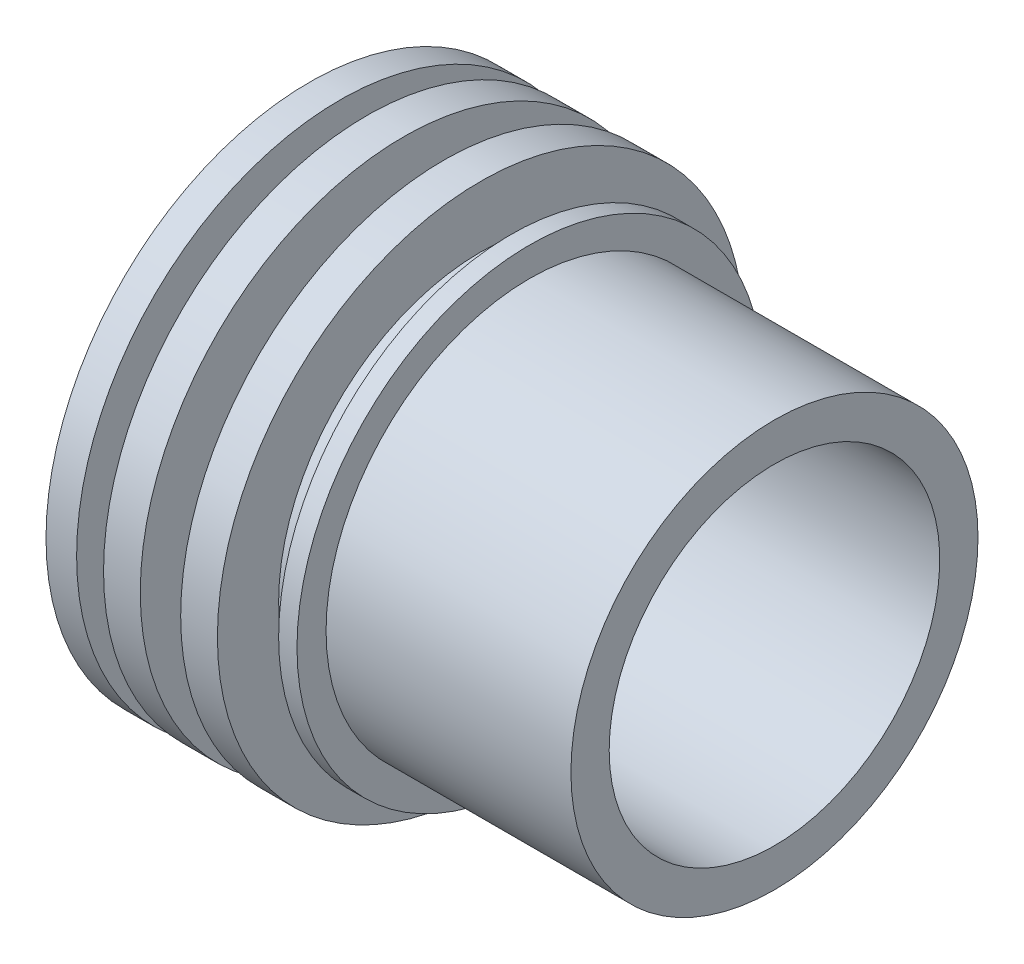
ISO-10303-21;
HEADER;
FILE_DESCRIPTION(('STEP AP214'),'2;1');
FILE_NAME('part.step','',(''),(''),'','','');
FILE_SCHEMA(('AUTOMOTIVE_DESIGN { 1 0 10303 214 1 1 1 1 }'));
ENDSEC;
DATA;
#1=APPLICATION_CONTEXT('core data for automotive mechanical design processes');
#2=APPLICATION_PROTOCOL_DEFINITION('international standard','automotive_design',2000,#1);
#3=PRODUCT_CONTEXT('',#1,'mechanical');
#4=PRODUCT('Part','Part','',(#3));
#5=PRODUCT_RELATED_PRODUCT_CATEGORY('part','',(#4));
#6=PRODUCT_DEFINITION_FORMATION('','',#4);
#7=PRODUCT_DEFINITION_CONTEXT('part definition',#1,'design');
#8=PRODUCT_DEFINITION('design','',#6,#7);
#9=PRODUCT_DEFINITION_SHAPE('','',#8);
#10=(LENGTH_UNIT() NAMED_UNIT(*) SI_UNIT(.MILLI.,.METRE.));
#11=(NAMED_UNIT(*) PLANE_ANGLE_UNIT() SI_UNIT($,.RADIAN.));
#12=(NAMED_UNIT(*) SI_UNIT($,.STERADIAN.) SOLID_ANGLE_UNIT());
#13=UNCERTAINTY_MEASURE_WITH_UNIT(LENGTH_MEASURE(1.E-05),#10,'distance_accuracy_value','');
#14=(GEOMETRIC_REPRESENTATION_CONTEXT(3) GLOBAL_UNCERTAINTY_ASSIGNED_CONTEXT((#13)) GLOBAL_UNIT_ASSIGNED_CONTEXT((#10,
#11,#12)) REPRESENTATION_CONTEXT('',''));
#15=CARTESIAN_POINT('',(0.,0.,0.));
#16=DIRECTION('',(0.,0.,1.));
#17=DIRECTION('',(1.,0.,0.));
#18=AXIS2_PLACEMENT_3D('',#15,#16,#17);
#19=CARTESIAN_POINT('',(29.,0.,0.));
#20=DIRECTION('',(-1.,0.,0.));
#21=DIRECTION('',(0.,0.,1.));
#22=AXIS2_PLACEMENT_3D('',#19,#20,#21);
#23=CYLINDRICAL_SURFACE('',#22,12.7);
#24=CARTESIAN_POINT('',(30.,0.,0.));
#25=DIRECTION('',(1.,0.,0.));
#26=DIRECTION('',(0.,0.,1.));
#27=AXIS2_PLACEMENT_3D('',#24,#25,#26);
#28=CIRCLE('',#27,12.7);
#29=CARTESIAN_POINT('',(30.,0.,12.7));
#30=VERTEX_POINT('',#29);
#31=EDGE_CURVE('E10',#30,#30,#28,.T.);
#32=ORIENTED_EDGE('',*,*,#31,.T.);
#33=EDGE_LOOP('',(#32));
#34=FACE_BOUND('',#33,.T.);
#35=CARTESIAN_POINT('',(28.,0.,0.));
#36=DIRECTION('',(1.,0.,0.));
#37=DIRECTION('',(0.,0.,1.));
#38=AXIS2_PLACEMENT_3D('',#35,#36,#37);
#39=CIRCLE('',#38,12.7);
#40=CARTESIAN_POINT('',(28.,0.,12.7));
#41=VERTEX_POINT('',#40);
#42=EDGE_CURVE('E123',#41,#41,#39,.T.);
#43=ORIENTED_EDGE('',*,*,#42,.F.);
#44=EDGE_LOOP('',(#43));
#45=FACE_BOUND('',#44,.T.);
#46=ADVANCED_FACE('F15',(#34,#45),#23,.F.);
#47=CARTESIAN_POINT('',(30.,0.,13.1));
#48=DIRECTION('',(1.,0.,0.));
#49=DIRECTION('',(0.,0.,1.));
#50=AXIS2_PLACEMENT_3D('',#47,#48,#49);
#51=PLANE('',#50);
#52=CARTESIAN_POINT('',(30.,0.,0.));
#53=DIRECTION('',(1.,0.,0.));
#54=DIRECTION('',(0.,0.,1.));
#55=AXIS2_PLACEMENT_3D('',#52,#53,#54);
#56=CIRCLE('',#55,13.5);
#57=CARTESIAN_POINT('',(30.,0.,13.5));
#58=VERTEX_POINT('',#57);
#59=EDGE_CURVE('E24',#58,#58,#56,.T.);
#60=ORIENTED_EDGE('',*,*,#59,.T.);
#61=EDGE_LOOP('',(#60));
#62=FACE_BOUND('',#61,.T.);
#63=ORIENTED_EDGE('',*,*,#31,.F.);
#64=EDGE_LOOP('',(#63));
#65=FACE_BOUND('',#64,.T.);
#66=ADVANCED_FACE('F166',(#62,#65),#51,.T.);
#67=CARTESIAN_POINT('',(48.,0.,0.));
#68=DIRECTION('',(-1.,0.,0.));
#69=DIRECTION('',(0.,0.,1.));
#70=AXIS2_PLACEMENT_3D('',#67,#68,#69);
#71=CYLINDRICAL_SURFACE('',#70,13.5);
#72=CARTESIAN_POINT('',(66.,0.,0.));
#73=DIRECTION('',(1.,0.,0.));
#74=DIRECTION('',(0.,0.,1.));
#75=AXIS2_PLACEMENT_3D('',#72,#73,#74);
#76=CIRCLE('',#75,13.5);
#77=CARTESIAN_POINT('',(66.,0.,13.5));
#78=VERTEX_POINT('',#77);
#79=EDGE_CURVE('E109',#78,#78,#76,.T.);
#80=ORIENTED_EDGE('',*,*,#79,.T.);
#81=EDGE_LOOP('',(#80));
#82=FACE_BOUND('',#81,.T.);
#83=ORIENTED_EDGE('',*,*,#59,.F.);
#84=EDGE_LOOP('',(#83));
#85=FACE_BOUND('',#84,.T.);
#86=ADVANCED_FACE('F171',(#82,#85),#71,.F.);
#87=CARTESIAN_POINT('',(66.,0.,15.0625));
#88=DIRECTION('',(1.,0.,0.));
#89=DIRECTION('',(0.,0.,1.));
#90=AXIS2_PLACEMENT_3D('',#87,#88,#89);
#91=PLANE('',#90);
#92=CARTESIAN_POINT('',(66.,0.,0.));
#93=DIRECTION('',(1.,0.,0.));
#94=DIRECTION('',(0.,0.,1.));
#95=AXIS2_PLACEMENT_3D('',#92,#93,#94);
#96=CIRCLE('',#95,16.625);
#97=CARTESIAN_POINT('',(66.,0.,16.625));
#98=VERTEX_POINT('',#97);
#99=EDGE_CURVE('E107',#98,#98,#96,.T.);
#100=ORIENTED_EDGE('',*,*,#99,.T.);
#101=EDGE_LOOP('',(#100));
#102=FACE_BOUND('',#101,.T.);
#103=ORIENTED_EDGE('',*,*,#79,.F.);
#104=EDGE_LOOP('',(#103));
#105=FACE_BOUND('',#104,.T.);
#106=ADVANCED_FACE('F229',(#102,#105),#91,.T.);
#107=CARTESIAN_POINT('',(56.,0.,0.));
#108=DIRECTION('',(-1.,0.,0.));
#109=DIRECTION('',(0.,0.,1.));
#110=AXIS2_PLACEMENT_3D('',#107,#108,#109);
#111=CYLINDRICAL_SURFACE('',#110,16.625);
#112=CARTESIAN_POINT('',(46.,0.,0.));
#113=DIRECTION('',(1.,0.,0.));
#114=DIRECTION('',(0.,0.,1.));
#115=AXIS2_PLACEMENT_3D('',#112,#113,#114);
#116=CIRCLE('',#115,16.625);
#117=CARTESIAN_POINT('',(46.,0.,16.625));
#118=VERTEX_POINT('',#117);
#119=EDGE_CURVE('E110',#118,#118,#116,.T.);
#120=ORIENTED_EDGE('',*,*,#119,.T.);
#121=EDGE_LOOP('',(#120));
#122=FACE_BOUND('',#121,.T.);
#123=ORIENTED_EDGE('',*,*,#99,.F.);
#124=EDGE_LOOP('',(#123));
#125=FACE_BOUND('',#124,.T.);
#126=ADVANCED_FACE('F201',(#122,#125),#111,.T.);
#127=CARTESIAN_POINT('',(46.,0.,17.8125));
#128=DIRECTION('',(1.,0.,0.));
#129=DIRECTION('',(0.,0.,1.));
#130=AXIS2_PLACEMENT_3D('',#127,#128,#129);
#131=PLANE('',#130);
#132=CARTESIAN_POINT('',(46.,0.,0.));
#133=DIRECTION('',(1.,0.,0.));
#134=DIRECTION('',(0.,0.,1.));
#135=AXIS2_PLACEMENT_3D('',#132,#133,#134);
#136=CIRCLE('',#135,19.);
#137=CARTESIAN_POINT('',(46.,0.,19.));
#138=VERTEX_POINT('',#137);
#139=EDGE_CURVE('E130',#138,#138,#136,.T.);
#140=ORIENTED_EDGE('',*,*,#139,.T.);
#141=EDGE_LOOP('',(#140));
#142=FACE_BOUND('',#141,.T.);
#143=ORIENTED_EDGE('',*,*,#119,.F.);
#144=EDGE_LOOP('',(#143));
#145=FACE_BOUND('',#144,.T.);
#146=ADVANCED_FACE('F194',(#142,#145),#131,.T.);
#147=CARTESIAN_POINT('',(45.25,0.,0.));
#148=DIRECTION('',(-1.,0.,0.));
#149=DIRECTION('',(0.,0.,1.));
#150=AXIS2_PLACEMENT_3D('',#147,#148,#149);
#151=CYLINDRICAL_SURFACE('',#150,19.);
#152=CARTESIAN_POINT('',(44.5,0.,0.));
#153=DIRECTION('',(1.,0.,0.));
#154=DIRECTION('',(0.,0.,1.));
#155=AXIS2_PLACEMENT_3D('',#152,#153,#154);
#156=CIRCLE('',#155,19.);
#157=CARTESIAN_POINT('',(44.5,0.,19.));
#158=VERTEX_POINT('',#157);
#159=EDGE_CURVE('E128',#158,#158,#156,.T.);
#160=ORIENTED_EDGE('',*,*,#159,.T.);
#161=EDGE_LOOP('',(#160));
#162=FACE_BOUND('',#161,.T.);
#163=ORIENTED_EDGE('',*,*,#139,.F.);
#164=EDGE_LOOP('',(#163));
#165=FACE_BOUND('',#164,.T.);
#166=ADVANCED_FACE('F190',(#162,#165),#151,.T.);
#167=CARTESIAN_POINT('',(44.5,0.,17.75));
#168=DIRECTION('',(-1.,0.,0.));
#169=DIRECTION('',(0.,0.,-1.));
#170=AXIS2_PLACEMENT_3D('',#167,#168,#169);
#171=PLANE('',#170);
#172=CARTESIAN_POINT('',(44.5,0.,0.));
#173=DIRECTION('',(1.,0.,0.));
#174=DIRECTION('',(0.,0.,1.));
#175=AXIS2_PLACEMENT_3D('',#172,#173,#174);
#176=CIRCLE('',#175,16.5);
#177=CARTESIAN_POINT('',(44.5,0.,16.5));
#178=VERTEX_POINT('',#177);
#179=EDGE_CURVE('E102',#178,#178,#176,.T.);
#180=ORIENTED_EDGE('',*,*,#179,.T.);
#181=EDGE_LOOP('',(#180));
#182=FACE_BOUND('',#181,.T.);
#183=ORIENTED_EDGE('',*,*,#159,.F.);
#184=EDGE_LOOP('',(#183));
#185=FACE_BOUND('',#184,.T.);
#186=ADVANCED_FACE('F193',(#182,#185),#171,.T.);
#187=CARTESIAN_POINT('',(43.25,0.,0.));
#188=DIRECTION('',(-1.,0.,0.));
#189=DIRECTION('',(0.,0.,1.));
#190=AXIS2_PLACEMENT_3D('',#187,#188,#189);
#191=CYLINDRICAL_SURFACE('',#190,16.5);
#192=CARTESIAN_POINT('',(42.,0.,0.));
#193=DIRECTION('',(1.,0.,0.));
#194=DIRECTION('',(0.,0.,1.));
#195=AXIS2_PLACEMENT_3D('',#192,#193,#194);
#196=CIRCLE('',#195,16.5);
#197=CARTESIAN_POINT('',(42.,0.,16.5));
#198=VERTEX_POINT('',#197);
#199=EDGE_CURVE('E99',#198,#198,#196,.T.);
#200=ORIENTED_EDGE('',*,*,#199,.T.);
#201=EDGE_LOOP('',(#200));
#202=FACE_BOUND('',#201,.T.);
#203=ORIENTED_EDGE('',*,*,#179,.F.);
#204=EDGE_LOOP('',(#203));
#205=FACE_BOUND('',#204,.T.);
#206=ADVANCED_FACE('F198',(#202,#205),#191,.T.);
#207=CARTESIAN_POINT('',(42.,0.,19.));
#208=DIRECTION('',(1.,0.,0.));
#209=DIRECTION('',(0.,0.,1.));
#210=AXIS2_PLACEMENT_3D('',#207,#208,#209);
#211=PLANE('',#210);
#212=CARTESIAN_POINT('',(42.,0.,0.));
#213=DIRECTION('',(1.,0.,0.));
#214=DIRECTION('',(0.,0.,1.));
#215=AXIS2_PLACEMENT_3D('',#212,#213,#214);
#216=CIRCLE('',#215,21.5);
#217=CARTESIAN_POINT('',(42.,0.,21.5));
#218=VERTEX_POINT('',#217);
#219=EDGE_CURVE('E95',#218,#218,#216,.T.);
#220=ORIENTED_EDGE('',*,*,#219,.T.);
#221=EDGE_LOOP('',(#220));
#222=FACE_BOUND('',#221,.T.);
#223=ORIENTED_EDGE('',*,*,#199,.F.);
#224=EDGE_LOOP('',(#223));
#225=FACE_BOUND('',#224,.T.);
#226=ADVANCED_FACE('F96',(#222,#225),#211,.T.);
#227=CARTESIAN_POINT('',(40.5,0.,0.));
#228=DIRECTION('',(-1.,0.,0.));
#229=DIRECTION('',(0.,0.,1.));
#230=AXIS2_PLACEMENT_3D('',#227,#228,#229);
#231=CYLINDRICAL_SURFACE('',#230,21.5);
#232=CARTESIAN_POINT('',(39.,0.,0.));
#233=DIRECTION('',(1.,0.,0.));
#234=DIRECTION('',(0.,0.,1.));
#235=AXIS2_PLACEMENT_3D('',#232,#233,#234);
#236=CIRCLE('',#235,21.5);
#237=CARTESIAN_POINT('',(39.,0.,21.5));
#238=VERTEX_POINT('',#237);
#239=EDGE_CURVE('E100',#238,#238,#236,.T.);
#240=ORIENTED_EDGE('',*,*,#239,.T.);
#241=EDGE_LOOP('',(#240));
#242=FACE_BOUND('',#241,.T.);
#243=ORIENTED_EDGE('',*,*,#219,.F.);
#244=EDGE_LOOP('',(#243));
#245=FACE_BOUND('',#244,.T.);
#246=ADVANCED_FACE('F181',(#242,#245),#231,.T.);
#247=CARTESIAN_POINT('',(39.,0.,19.));
#248=DIRECTION('',(-1.,0.,0.));
#249=DIRECTION('',(0.,0.,-1.));
#250=AXIS2_PLACEMENT_3D('',#247,#248,#249);
#251=PLANE('',#250);
#252=CARTESIAN_POINT('',(39.,0.,0.));
#253=DIRECTION('',(1.,0.,0.));
#254=DIRECTION('',(0.,0.,1.));
#255=AXIS2_PLACEMENT_3D('',#252,#253,#254);
#256=CIRCLE('',#255,16.5);
#257=CARTESIAN_POINT('',(39.,0.,16.5));
#258=VERTEX_POINT('',#257);
#259=EDGE_CURVE('E104',#258,#258,#256,.T.);
#260=ORIENTED_EDGE('',*,*,#259,.T.);
#261=EDGE_LOOP('',(#260));
#262=FACE_BOUND('',#261,.T.);
#263=ORIENTED_EDGE('',*,*,#239,.F.);
#264=EDGE_LOOP('',(#263));
#265=FACE_BOUND('',#264,.T.);
#266=ADVANCED_FACE('F177',(#262,#265),#251,.T.);
#267=CARTESIAN_POINT('',(37.35,0.,0.));
#268=DIRECTION('',(-1.,0.,0.));
#269=DIRECTION('',(0.,0.,1.));
#270=AXIS2_PLACEMENT_3D('',#267,#268,#269);
#271=CYLINDRICAL_SURFACE('',#270,16.5);
#272=CARTESIAN_POINT('',(35.7,0.,0.));
#273=DIRECTION('',(1.,0.,0.));
#274=DIRECTION('',(0.,0.,1.));
#275=AXIS2_PLACEMENT_3D('',#272,#273,#274);
#276=CIRCLE('',#275,16.5);
#277=CARTESIAN_POINT('',(35.7,0.,16.5));
#278=VERTEX_POINT('',#277);
#279=EDGE_CURVE('E124',#278,#278,#276,.T.);
#280=ORIENTED_EDGE('',*,*,#279,.T.);
#281=EDGE_LOOP('',(#280));
#282=FACE_BOUND('',#281,.T.);
#283=ORIENTED_EDGE('',*,*,#259,.F.);
#284=EDGE_LOOP('',(#283));
#285=FACE_BOUND('',#284,.T.);
#286=ADVANCED_FACE('F180',(#282,#285),#271,.T.);
#287=CARTESIAN_POINT('',(35.7,0.,19.));
#288=DIRECTION('',(1.,0.,0.));
#289=DIRECTION('',(0.,0.,1.));
#290=AXIS2_PLACEMENT_3D('',#287,#288,#289);
#291=PLANE('',#290);
#292=CARTESIAN_POINT('',(35.7,0.,0.));
#293=DIRECTION('',(1.,0.,0.));
#294=DIRECTION('',(0.,0.,1.));
#295=AXIS2_PLACEMENT_3D('',#292,#293,#294);
#296=CIRCLE('',#295,21.5);
#297=CARTESIAN_POINT('',(35.7,0.,21.5));
#298=VERTEX_POINT('',#297);
#299=EDGE_CURVE('E126',#298,#298,#296,.T.);
#300=ORIENTED_EDGE('',*,*,#299,.T.);
#301=EDGE_LOOP('',(#300));
#302=FACE_BOUND('',#301,.T.);
#303=ORIENTED_EDGE('',*,*,#279,.F.);
#304=EDGE_LOOP('',(#303));
#305=FACE_BOUND('',#304,.T.);
#306=ADVANCED_FACE('F209',(#302,#305),#291,.T.);
#307=CARTESIAN_POINT('',(34.2,0.,0.));
#308=DIRECTION('',(-1.,0.,0.));
#309=DIRECTION('',(0.,0.,1.));
#310=AXIS2_PLACEMENT_3D('',#307,#308,#309);
#311=CYLINDRICAL_SURFACE('',#310,21.5);
#312=CARTESIAN_POINT('',(32.7,0.,0.));
#313=DIRECTION('',(1.,0.,0.));
#314=DIRECTION('',(0.,0.,1.));
#315=AXIS2_PLACEMENT_3D('',#312,#313,#314);
#316=CIRCLE('',#315,21.5);
#317=CARTESIAN_POINT('',(32.7,0.,21.5));
#318=VERTEX_POINT('',#317);
#319=EDGE_CURVE('E121',#318,#318,#316,.T.);
#320=ORIENTED_EDGE('',*,*,#319,.T.);
#321=EDGE_LOOP('',(#320));
#322=FACE_BOUND('',#321,.T.);
#323=ORIENTED_EDGE('',*,*,#299,.F.);
#324=EDGE_LOOP('',(#323));
#325=FACE_BOUND('',#324,.T.);
#326=ADVANCED_FACE('F206',(#322,#325),#311,.T.);
#327=CARTESIAN_POINT('',(32.7,0.,19.375));
#328=DIRECTION('',(-1.,0.,0.));
#329=DIRECTION('',(0.,0.,-1.));
#330=AXIS2_PLACEMENT_3D('',#327,#328,#329);
#331=PLANE('',#330);
#332=CARTESIAN_POINT('',(32.7,0.,0.));
#333=DIRECTION('',(1.,0.,0.));
#334=DIRECTION('',(0.,0.,1.));
#335=AXIS2_PLACEMENT_3D('',#332,#333,#334);
#336=CIRCLE('',#335,17.25);
#337=CARTESIAN_POINT('',(32.7,0.,17.25));
#338=VERTEX_POINT('',#337);
#339=EDGE_CURVE('E119',#338,#338,#336,.T.);
#340=ORIENTED_EDGE('',*,*,#339,.T.);
#341=EDGE_LOOP('',(#340));
#342=FACE_BOUND('',#341,.T.);
#343=ORIENTED_EDGE('',*,*,#319,.F.);
#344=EDGE_LOOP('',(#343));
#345=FACE_BOUND('',#344,.T.);
#346=ADVANCED_FACE('F161',(#342,#345),#331,.T.);
#347=CARTESIAN_POINT('',(31.6,0.,0.));
#348=DIRECTION('',(-1.,0.,0.));
#349=DIRECTION('',(0.,0.,1.));
#350=AXIS2_PLACEMENT_3D('',#347,#348,#349);
#351=CYLINDRICAL_SURFACE('',#350,17.25);
#352=CARTESIAN_POINT('',(30.5,0.,0.));
#353=DIRECTION('',(1.,0.,0.));
#354=DIRECTION('',(0.,0.,1.));
#355=AXIS2_PLACEMENT_3D('',#352,#353,#354);
#356=CIRCLE('',#355,17.25);
#357=CARTESIAN_POINT('',(30.5,0.,17.25));
#358=VERTEX_POINT('',#357);
#359=EDGE_CURVE('E112',#358,#358,#356,.T.);
#360=ORIENTED_EDGE('',*,*,#359,.T.);
#361=EDGE_LOOP('',(#360));
#362=FACE_BOUND('',#361,.T.);
#363=ORIENTED_EDGE('',*,*,#339,.F.);
#364=EDGE_LOOP('',(#363));
#365=FACE_BOUND('',#364,.T.);
#366=ADVANCED_FACE('F145',(#362,#365),#351,.T.);
#367=CARTESIAN_POINT('',(30.5,0.,19.375));
#368=DIRECTION('',(1.,0.,0.));
#369=DIRECTION('',(0.,0.,1.));
#370=AXIS2_PLACEMENT_3D('',#367,#368,#369);
#371=PLANE('',#370);
#372=CARTESIAN_POINT('',(30.5,0.,0.));
#373=DIRECTION('',(1.,0.,0.));
#374=DIRECTION('',(0.,0.,1.));
#375=AXIS2_PLACEMENT_3D('',#372,#373,#374);
#376=CIRCLE('',#375,21.5);
#377=CARTESIAN_POINT('',(30.5,0.,21.5));
#378=VERTEX_POINT('',#377);
#379=EDGE_CURVE('E111',#378,#378,#376,.T.);
#380=ORIENTED_EDGE('',*,*,#379,.T.);
#381=EDGE_LOOP('',(#380));
#382=FACE_BOUND('',#381,.T.);
#383=ORIENTED_EDGE('',*,*,#359,.F.);
#384=EDGE_LOOP('',(#383));
#385=FACE_BOUND('',#384,.T.);
#386=ADVANCED_FACE('F148',(#382,#385),#371,.T.);
#387=CARTESIAN_POINT('',(29.25,0.,0.));
#388=DIRECTION('',(-1.,0.,0.));
#389=DIRECTION('',(0.,0.,1.));
#390=AXIS2_PLACEMENT_3D('',#387,#388,#389);
#391=CYLINDRICAL_SURFACE('',#390,21.5);
#392=CARTESIAN_POINT('',(28.,0.,0.));
#393=DIRECTION('',(1.,0.,0.));
#394=DIRECTION('',(0.,0.,1.));
#395=AXIS2_PLACEMENT_3D('',#392,#393,#394);
#396=CIRCLE('',#395,21.5);
#397=CARTESIAN_POINT('',(28.,0.,21.5));
#398=VERTEX_POINT('',#397);
#399=EDGE_CURVE('E113',#398,#398,#396,.T.);
#400=ORIENTED_EDGE('',*,*,#399,.T.);
#401=EDGE_LOOP('',(#400));
#402=FACE_BOUND('',#401,.T.);
#403=ORIENTED_EDGE('',*,*,#379,.F.);
#404=EDGE_LOOP('',(#403));
#405=FACE_BOUND('',#404,.T.);
#406=ADVANCED_FACE('F150',(#402,#405),#391,.T.);
#407=CARTESIAN_POINT('',(28.,0.,19.5));
#408=DIRECTION('',(-1.,0.,0.));
#409=DIRECTION('',(0.,0.,-1.));
#410=AXIS2_PLACEMENT_3D('',#407,#408,#409);
#411=PLANE('',#410);
#412=CARTESIAN_POINT('',(28.,0.,0.));
#413=DIRECTION('',(1.,0.,0.));
#414=DIRECTION('',(0.,0.,1.));
#415=AXIS2_PLACEMENT_3D('',#412,#413,#414);
#416=CIRCLE('',#415,17.5);
#417=CARTESIAN_POINT('',(28.,0.,17.5));
#418=VERTEX_POINT('',#417);
#419=EDGE_CURVE('E117',#418,#418,#416,.T.);
#420=ORIENTED_EDGE('',*,*,#419,.T.);
#421=EDGE_LOOP('',(#420));
#422=FACE_BOUND('',#421,.T.);
#423=ORIENTED_EDGE('',*,*,#399,.F.);
#424=EDGE_LOOP('',(#423));
#425=FACE_BOUND('',#424,.T.);
#426=ADVANCED_FACE('F158',(#422,#425),#411,.T.);
#427=CARTESIAN_POINT('',(28.6,0.,0.));
#428=DIRECTION('',(-1.,0.,0.));
#429=DIRECTION('',(0.,0.,1.));
#430=AXIS2_PLACEMENT_3D('',#427,#428,#429);
#431=CYLINDRICAL_SURFACE('',#430,17.5);
#432=CARTESIAN_POINT('',(29.2,0.,0.));
#433=DIRECTION('',(1.,0.,0.));
#434=DIRECTION('',(0.,0.,1.));
#435=AXIS2_PLACEMENT_3D('',#432,#433,#434);
#436=CIRCLE('',#435,17.5);
#437=CARTESIAN_POINT('',(29.2,0.,17.5));
#438=VERTEX_POINT('',#437);
#439=EDGE_CURVE('E115',#438,#438,#436,.T.);
#440=ORIENTED_EDGE('',*,*,#439,.T.);
#441=EDGE_LOOP('',(#440));
#442=FACE_BOUND('',#441,.T.);
#443=ORIENTED_EDGE('',*,*,#419,.F.);
#444=EDGE_LOOP('',(#443));
#445=FACE_BOUND('',#444,.T.);
#446=ADVANCED_FACE('F187',(#442,#445),#431,.F.);
#447=CARTESIAN_POINT('',(29.2,0.,16.));
#448=DIRECTION('',(-1.,0.,0.));
#449=DIRECTION('',(0.,0.,-1.));
#450=AXIS2_PLACEMENT_3D('',#447,#448,#449);
#451=PLANE('',#450);
#452=CARTESIAN_POINT('',(29.2,0.,0.));
#453=DIRECTION('',(1.,0.,0.));
#454=DIRECTION('',(0.,0.,1.));
#455=AXIS2_PLACEMENT_3D('',#452,#453,#454);
#456=CIRCLE('',#455,14.5);
#457=CARTESIAN_POINT('',(29.2,0.,14.5));
#458=VERTEX_POINT('',#457);
#459=EDGE_CURVE('E118',#458,#458,#456,.T.);
#460=ORIENTED_EDGE('',*,*,#459,.T.);
#461=EDGE_LOOP('',(#460));
#462=FACE_BOUND('',#461,.T.);
#463=ORIENTED_EDGE('',*,*,#439,.F.);
#464=EDGE_LOOP('',(#463));
#465=FACE_BOUND('',#464,.T.);
#466=ADVANCED_FACE('F253',(#462,#465),#451,.T.);
#467=CARTESIAN_POINT('',(28.6,0.,0.));
#468=DIRECTION('',(-1.,0.,0.));
#469=DIRECTION('',(0.,0.,1.));
#470=AXIS2_PLACEMENT_3D('',#467,#468,#469);
#471=CYLINDRICAL_SURFACE('',#470,14.5);
#472=CARTESIAN_POINT('',(28.,0.,0.));
#473=DIRECTION('',(1.,0.,0.));
#474=DIRECTION('',(0.,0.,1.));
#475=AXIS2_PLACEMENT_3D('',#472,#473,#474);
#476=CIRCLE('',#475,14.5);
#477=CARTESIAN_POINT('',(28.,0.,14.5));
#478=VERTEX_POINT('',#477);
#479=EDGE_CURVE('E134',#478,#478,#476,.T.);
#480=ORIENTED_EDGE('',*,*,#479,.T.);
#481=EDGE_LOOP('',(#480));
#482=FACE_BOUND('',#481,.T.);
#483=ORIENTED_EDGE('',*,*,#459,.F.);
#484=EDGE_LOOP('',(#483));
#485=FACE_BOUND('',#484,.T.);
#486=ADVANCED_FACE('F17',(#482,#485),#471,.T.);
#487=CARTESIAN_POINT('',(28.,0.,13.6));
#488=DIRECTION('',(-1.,0.,0.));
#489=DIRECTION('',(0.,0.,-1.));
#490=AXIS2_PLACEMENT_3D('',#487,#488,#489);
#491=PLANE('',#490);
#492=ORIENTED_EDGE('',*,*,#42,.T.);
#493=EDGE_LOOP('',(#492));
#494=FACE_BOUND('',#493,.T.);
#495=ORIENTED_EDGE('',*,*,#479,.F.);
#496=EDGE_LOOP('',(#495));
#497=FACE_BOUND('',#496,.T.);
#498=ADVANCED_FACE('F248',(#494,#497),#491,.T.);
#499=CLOSED_SHELL('',(#46,#66,#86,#106,#126,#146,#166,#186,#206,#226,#246,#266,#286,#306,#326,
#346,#366,#386,#406,#426,#446,#466,#486,#498));
#500=MANIFOLD_SOLID_BREP('B1',#499);
#501=ADVANCED_BREP_SHAPE_REPRESENTATION('',(#18,#500),#14);
#502=SHAPE_DEFINITION_REPRESENTATION(#9,#501);
ENDSEC;
END-ISO-10303-21;
